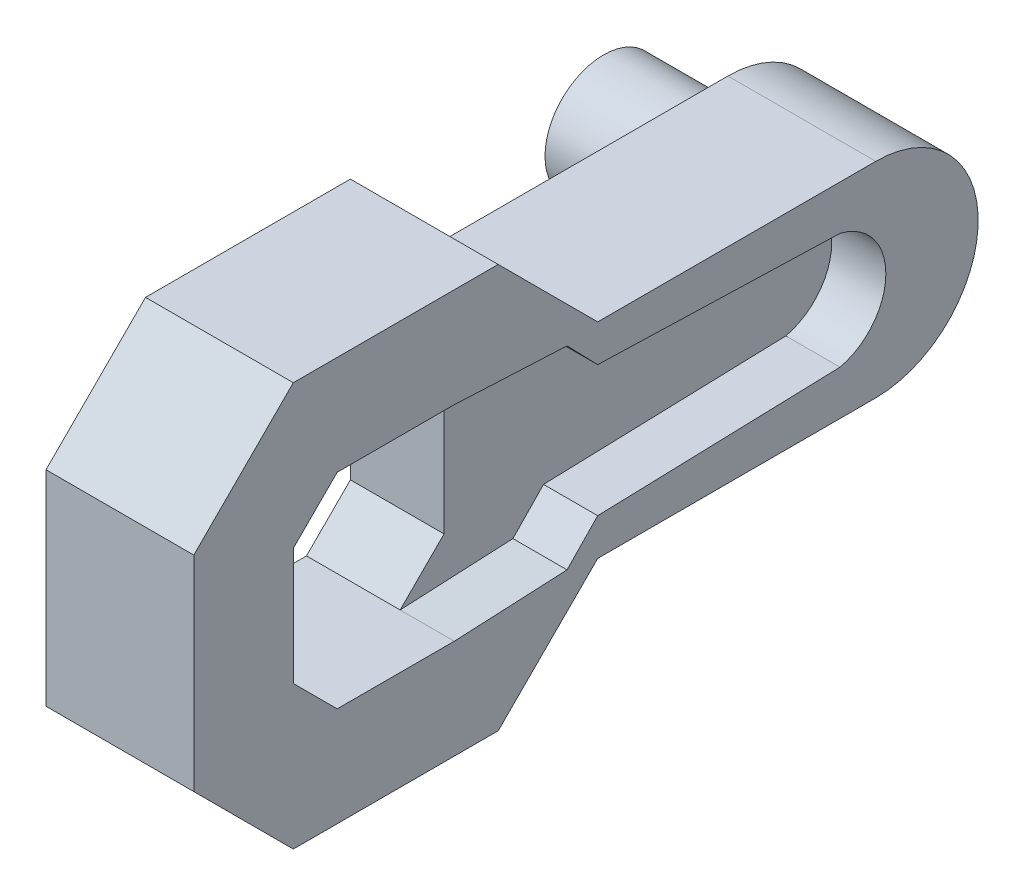
ISO-10303-21;
HEADER;
FILE_DESCRIPTION(('STEP AP214'),'2;1');
FILE_NAME('part.step','',(''),(''),'','','');
FILE_SCHEMA(('AUTOMOTIVE_DESIGN { 1 0 10303 214 1 1 1 1 }'));
ENDSEC;
DATA;
#1=APPLICATION_CONTEXT('core data for automotive mechanical design processes');
#2=APPLICATION_PROTOCOL_DEFINITION('international standard','automotive_design',2000,#1);
#3=PRODUCT_CONTEXT('',#1,'mechanical');
#4=PRODUCT('Part','Part','',(#3));
#5=PRODUCT_RELATED_PRODUCT_CATEGORY('part','',(#4));
#6=PRODUCT_DEFINITION_FORMATION('','',#4);
#7=PRODUCT_DEFINITION_CONTEXT('part definition',#1,'design');
#8=PRODUCT_DEFINITION('design','',#6,#7);
#9=PRODUCT_DEFINITION_SHAPE('','',#8);
#10=(LENGTH_UNIT() NAMED_UNIT(*) SI_UNIT(.MILLI.,.METRE.));
#11=(NAMED_UNIT(*) PLANE_ANGLE_UNIT() SI_UNIT($,.RADIAN.));
#12=(NAMED_UNIT(*) SI_UNIT($,.STERADIAN.) SOLID_ANGLE_UNIT());
#13=UNCERTAINTY_MEASURE_WITH_UNIT(LENGTH_MEASURE(1.E-05),#10,'distance_accuracy_value','');
#14=(GEOMETRIC_REPRESENTATION_CONTEXT(3) GLOBAL_UNCERTAINTY_ASSIGNED_CONTEXT((#13)) GLOBAL_UNIT_ASSIGNED_CONTEXT((#10,
#11,#12)) REPRESENTATION_CONTEXT('',''));
#15=CARTESIAN_POINT('',(0.,0.,0.));
#16=DIRECTION('',(0.,0.,1.));
#17=DIRECTION('',(1.,0.,0.));
#18=AXIS2_PLACEMENT_3D('',#15,#16,#17);
#19=CARTESIAN_POINT('',(3.2,0.,0.));
#20=DIRECTION('',(1.,0.,0.));
#21=DIRECTION('',(0.,0.,-1.));
#22=AXIS2_PLACEMENT_3D('',#19,#20,#21);
#23=PLANE('',#22);
#24=DIRECTION('',(0.,0.707106781186544,-0.707106781186551));
#25=VECTOR('',#24,1.);
#26=CARTESIAN_POINT('',(3.2,-3.5,-1.99999999999999));
#27=LINE('',#26,#25);
#28=CARTESIAN_POINT('',(3.2,-2.00000000000001,-3.5));
#29=VERTEX_POINT('',#28);
#30=CARTESIAN_POINT('',(3.2,-3.5,-1.99999999999999));
#31=VERTEX_POINT('',#30);
#32=EDGE_CURVE('E398',#29,#31,#27,.F.);
#33=ORIENTED_EDGE('',*,*,#32,.T.);
#34=DIRECTION('',(0.,-0.0481321510759977,0.998840976348486));
#35=VECTOR('',#34,1.);
#36=CARTESIAN_POINT('',(3.2,-3.58804426566379,-0.172900684645164));
#37=LINE('',#36,#35);
#38=CARTESIAN_POINT('',(3.2,-3.31433472381521,-5.85293575276977));
#39=VERTEX_POINT('',#38);
#40=EDGE_CURVE('E247',#39,#31,#37,.T.);
#41=ORIENTED_EDGE('',*,*,#40,.F.);
#42=DIRECTION('',(0.,-0.717900092453598,0.696146146477243));
#43=VECTOR('',#42,1.);
#44=CARTESIAN_POINT('',(3.2,-2.23455065304895,-6.90000000000001));
#45=LINE('',#44,#43);
#46=CARTESIAN_POINT('',(3.2,-2.23455065304895,-6.90000000000001));
#47=VERTEX_POINT('',#46);
#48=EDGE_CURVE('E299',#47,#39,#45,.T.);
#49=ORIENTED_EDGE('',*,*,#48,.F.);
#50=DIRECTION('',(0.,-0.0307610854897689,0.999526765834458));
#51=VECTOR('',#50,1.);
#52=CARTESIAN_POINT('',(3.2,-2.23455065304895,-6.90000000000001));
#53=LINE('',#52,#51);
#54=CARTESIAN_POINT('',(3.2,-1.97976035461889,-15.1789576148247));
#55=VERTEX_POINT('',#54);
#56=EDGE_CURVE('E315',#55,#47,#53,.T.);
#57=ORIENTED_EDGE('',*,*,#56,.F.);
#58=CARTESIAN_POINT('',(3.2,0.,-14.7117047366577));
#59=DIRECTION('',(-1.,0.,0.));
#60=DIRECTION('',(0.,0.,-1.));
#61=AXIS2_PLACEMENT_3D('',#58,#59,#60);
#62=CIRCLE('',#61,2.03415248048815);
#63=CARTESIAN_POINT('',(3.2,1.97976035461889,-15.1789576148247));
#64=VERTEX_POINT('',#63);
#65=EDGE_CURVE('E313',#64,#55,#62,.T.);
#66=ORIENTED_EDGE('',*,*,#65,.F.);
#67=DIRECTION('',(0.,-0.0307610854897688,-0.999526765834458));
#68=VECTOR('',#67,1.);
#69=CARTESIAN_POINT('',(3.2,2.23455065304895,-6.90000000000001));
#70=LINE('',#69,#68);
#71=CARTESIAN_POINT('',(3.2,2.23455065304895,-6.90000000000001));
#72=VERTEX_POINT('',#71);
#73=EDGE_CURVE('E311',#72,#64,#70,.T.);
#74=ORIENTED_EDGE('',*,*,#73,.F.);
#75=DIRECTION('',(0.,-0.717900092453598,-0.696146146477243));
#76=VECTOR('',#75,1.);
#77=CARTESIAN_POINT('',(3.2,2.23455065304895,-6.90000000000001));
#78=LINE('',#77,#76);
#79=CARTESIAN_POINT('',(3.2,3.31433472381521,-5.85293575276977));
#80=VERTEX_POINT('',#79);
#81=EDGE_CURVE('E294',#80,#72,#78,.T.);
#82=ORIENTED_EDGE('',*,*,#81,.F.);
#83=DIRECTION('',(0.,0.0481321510759978,0.998840976348486));
#84=VECTOR('',#83,1.);
#85=CARTESIAN_POINT('',(3.2,3.5880442656638,-0.172900684645164));
#86=LINE('',#85,#84);
#87=CARTESIAN_POINT('',(3.2,3.5,-2.00000000000001));
#88=VERTEX_POINT('',#87);
#89=EDGE_CURVE('E244',#80,#88,#86,.T.);
#90=ORIENTED_EDGE('',*,*,#89,.T.);
#91=DIRECTION('',(0.,0.707106781186551,0.707106781186544));
#92=VECTOR('',#91,1.);
#93=CARTESIAN_POINT('',(3.2,2.,-3.5));
#94=LINE('',#93,#92);
#95=CARTESIAN_POINT('',(3.2,2.,-3.5));
#96=VERTEX_POINT('',#95);
#97=EDGE_CURVE('E394',#88,#96,#94,.F.);
#98=ORIENTED_EDGE('',*,*,#97,.T.);
#99=DIRECTION('',(0.,1.,0.));
#100=VECTOR('',#99,1.);
#101=CARTESIAN_POINT('',(3.2,-3.5,-3.5));
#102=LINE('',#101,#100);
#103=EDGE_CURVE('E338',#29,#96,#102,.T.);
#104=ORIENTED_EDGE('',*,*,#103,.F.);
#105=EDGE_LOOP('',(#33,#41,#49,#57,#66,#74,#82,#90,#98,#104));
#106=FACE_BOUND('',#105,.T.);
#107=ADVANCED_FACE('F42',(#106),#23,.T.);
#108=CARTESIAN_POINT('',(0.,0.,0.));
#109=DIRECTION('',(1.,0.,0.));
#110=DIRECTION('',(0.,0.,-1.));
#111=AXIS2_PLACEMENT_3D('',#108,#109,#110);
#112=PLANE('',#111);
#113=CARTESIAN_POINT('',(0.,0.,-16.4));
#114=DIRECTION('',(1.,0.,0.));
#115=DIRECTION('',(0.,0.,-1.));
#116=AXIS2_PLACEMENT_3D('',#113,#114,#115);
#117=CIRCLE('',#116,2.);
#118=CARTESIAN_POINT('',(0.,0.,-18.4));
#119=VERTEX_POINT('',#118);
#120=EDGE_CURVE('E11',#119,#119,#117,.F.);
#121=ORIENTED_EDGE('',*,*,#120,.F.);
#122=EDGE_LOOP('',(#121));
#123=FACE_BOUND('',#122,.T.);
#124=DIRECTION('',(0.,0.,-1.));
#125=VECTOR('',#124,1.);
#126=CARTESIAN_POINT('',(0.,-3.5,-6.90000000000001));
#127=LINE('',#126,#125);
#128=CARTESIAN_POINT('',(0.,-3.5,-6.90000000000001));
#129=VERTEX_POINT('',#128);
#130=CARTESIAN_POINT('',(0.,-3.5,-16.4));
#131=VERTEX_POINT('',#130);
#132=EDGE_CURVE('E360',#129,#131,#127,.T.);
#133=ORIENTED_EDGE('',*,*,#132,.F.);
#134=DIRECTION('',(0.,0.707106781186546,-0.707106781186549));
#135=VECTOR('',#134,1.);
#136=CARTESIAN_POINT('',(0.,-3.5,-6.90000000000001));
#137=LINE('',#136,#135);
#138=CARTESIAN_POINT('',(0.,-6.9,-3.49999999999999));
#139=VERTEX_POINT('',#138);
#140=EDGE_CURVE('E228',#129,#139,#137,.F.);
#141=ORIENTED_EDGE('',*,*,#140,.T.);
#142=DIRECTION('',(0.,0.,-1.));
#143=VECTOR('',#142,1.);
#144=CARTESIAN_POINT('',(0.,-6.9,6.9));
#145=LINE('',#144,#143);
#146=CARTESIAN_POINT('',(0.,-6.9,3.5));
#147=VERTEX_POINT('',#146);
#148=EDGE_CURVE('E358',#147,#139,#145,.T.);
#149=ORIENTED_EDGE('',*,*,#148,.F.);
#150=DIRECTION('',(0.,-0.707106781186549,-0.707106781186546));
#151=VECTOR('',#150,1.);
#152=CARTESIAN_POINT('',(0.,-6.9,3.5));
#153=LINE('',#152,#151);
#154=CARTESIAN_POINT('',(0.,-3.49999999999999,6.9));
#155=VERTEX_POINT('',#154);
#156=EDGE_CURVE('E223',#147,#155,#153,.F.);
#157=ORIENTED_EDGE('',*,*,#156,.T.);
#158=DIRECTION('',(0.,-1.,0.));
#159=VECTOR('',#158,1.);
#160=CARTESIAN_POINT('',(0.,-6.9,6.9));
#161=LINE('',#160,#159);
#162=CARTESIAN_POINT('',(0.,3.5,6.9));
#163=VERTEX_POINT('',#162);
#164=EDGE_CURVE('E355',#163,#155,#161,.T.);
#165=ORIENTED_EDGE('',*,*,#164,.F.);
#166=DIRECTION('',(0.,-0.707106781186546,0.707106781186549));
#167=VECTOR('',#166,1.);
#168=CARTESIAN_POINT('',(0.,3.50000000000001,6.9));
#169=LINE('',#168,#167);
#170=CARTESIAN_POINT('',(0.,6.9,3.49999999999999));
#171=VERTEX_POINT('',#170);
#172=EDGE_CURVE('E58',#163,#171,#169,.F.);
#173=ORIENTED_EDGE('',*,*,#172,.T.);
#174=DIRECTION('',(0.,0.,1.));
#175=VECTOR('',#174,1.);
#176=CARTESIAN_POINT('',(0.,6.9,6.9));
#177=LINE('',#176,#175);
#178=CARTESIAN_POINT('',(0.,6.9,-3.50000000000001));
#179=VERTEX_POINT('',#178);
#180=EDGE_CURVE('E341',#179,#171,#177,.T.);
#181=ORIENTED_EDGE('',*,*,#180,.F.);
#182=DIRECTION('',(0.,0.707106781186548,0.707106781186547));
#183=VECTOR('',#182,1.);
#184=CARTESIAN_POINT('',(0.,6.9,-3.50000000000001));
#185=LINE('',#184,#183);
#186=CARTESIAN_POINT('',(0.,3.5,-6.90000000000001));
#187=VERTEX_POINT('',#186);
#188=EDGE_CURVE('E66',#179,#187,#185,.F.);
#189=ORIENTED_EDGE('',*,*,#188,.T.);
#190=DIRECTION('',(0.,0.,1.));
#191=VECTOR('',#190,1.);
#192=CARTESIAN_POINT('',(0.,3.5,-6.90000000000001));
#193=LINE('',#192,#191);
#194=CARTESIAN_POINT('',(0.,3.5,-16.4));
#195=VERTEX_POINT('',#194);
#196=EDGE_CURVE('E363',#195,#187,#193,.T.);
#197=ORIENTED_EDGE('',*,*,#196,.F.);
#198=CARTESIAN_POINT('',(0.,0.,-16.4));
#199=DIRECTION('',(1.,0.,0.));
#200=DIRECTION('',(0.,0.,-1.));
#201=AXIS2_PLACEMENT_3D('',#198,#199,#200);
#202=CIRCLE('',#201,3.5);
#203=CARTESIAN_POINT('',(0.,0.,-19.9));
#204=VERTEX_POINT('',#203);
#205=EDGE_CURVE('E405',#195,#204,#202,.F.);
#206=ORIENTED_EDGE('',*,*,#205,.T.);
#207=CARTESIAN_POINT('',(0.,0.,-16.4));
#208=DIRECTION('',(1.,0.,0.));
#209=DIRECTION('',(0.,0.,-1.));
#210=AXIS2_PLACEMENT_3D('',#207,#208,#209);
#211=CIRCLE('',#210,3.5);
#212=EDGE_CURVE('E407',#204,#131,#211,.F.);
#213=ORIENTED_EDGE('',*,*,#212,.T.);
#214=EDGE_LOOP('',(#133,#141,#149,#157,#165,#173,#181,#189,#197,#206,#213));
#215=FACE_BOUND('',#214,.T.);
#216=DIRECTION('',(0.,0.,-1.));
#217=VECTOR('',#216,1.);
#218=CARTESIAN_POINT('',(0.,-3.5,3.5));
#219=LINE('',#218,#217);
#220=CARTESIAN_POINT('',(0.,-3.5,2.));
#221=VERTEX_POINT('',#220);
#222=CARTESIAN_POINT('',(0.,-3.5,-1.99999999999999));
#223=VERTEX_POINT('',#222);
#224=EDGE_CURVE('E342',#221,#223,#219,.T.);
#225=ORIENTED_EDGE('',*,*,#224,.T.);
#226=DIRECTION('',(0.,-0.707106781186544,0.707106781186551));
#227=VECTOR('',#226,1.);
#228=CARTESIAN_POINT('',(0.,-2.75000000000001,-2.74999999999999));
#229=LINE('',#228,#227);
#230=CARTESIAN_POINT('',(0.,-2.00000000000001,-3.5));
#231=VERTEX_POINT('',#230);
#232=EDGE_CURVE('E396',#223,#231,#229,.F.);
#233=ORIENTED_EDGE('',*,*,#232,.T.);
#234=DIRECTION('',(0.,1.,0.));
#235=VECTOR('',#234,1.);
#236=CARTESIAN_POINT('',(0.,-3.5,-3.5));
#237=LINE('',#236,#235);
#238=CARTESIAN_POINT('',(0.,2.,-3.5));
#239=VERTEX_POINT('',#238);
#240=EDGE_CURVE('E343',#231,#239,#237,.T.);
#241=ORIENTED_EDGE('',*,*,#240,.T.);
#242=DIRECTION('',(0.,-0.707106781186551,-0.707106781186544));
#243=VECTOR('',#242,1.);
#244=CARTESIAN_POINT('',(0.,2.74999999999999,-2.75000000000001));
#245=LINE('',#244,#243);
#246=CARTESIAN_POINT('',(0.,3.5,-2.00000000000001));
#247=VERTEX_POINT('',#246);
#248=EDGE_CURVE('E392',#239,#247,#245,.F.);
#249=ORIENTED_EDGE('',*,*,#248,.T.);
#250=DIRECTION('',(0.,0.,1.));
#251=VECTOR('',#250,1.);
#252=CARTESIAN_POINT('',(0.,3.5,3.5));
#253=LINE('',#252,#251);
#254=CARTESIAN_POINT('',(0.,3.5,1.99999999999999));
#255=VERTEX_POINT('',#254);
#256=EDGE_CURVE('E346',#247,#255,#253,.T.);
#257=ORIENTED_EDGE('',*,*,#256,.T.);
#258=DIRECTION('',(0.,0.707106781186544,-0.707106781186551));
#259=VECTOR('',#258,1.);
#260=CARTESIAN_POINT('',(0.,2.75000000000001,2.74999999999999));
#261=LINE('',#260,#259);
#262=CARTESIAN_POINT('',(0.,2.00000000000001,3.5));
#263=VERTEX_POINT('',#262);
#264=EDGE_CURVE('E403',#255,#263,#261,.F.);
#265=ORIENTED_EDGE('',*,*,#264,.T.);
#266=DIRECTION('',(0.,-1.,0.));
#267=VECTOR('',#266,1.);
#268=CARTESIAN_POINT('',(0.,-3.5,3.5));
#269=LINE('',#268,#267);
#270=CARTESIAN_POINT('',(0.,-1.99999999999999,3.5));
#271=VERTEX_POINT('',#270);
#272=EDGE_CURVE('E349',#263,#271,#269,.T.);
#273=ORIENTED_EDGE('',*,*,#272,.T.);
#274=DIRECTION('',(0.,0.707106781186551,0.707106781186544));
#275=VECTOR('',#274,1.);
#276=CARTESIAN_POINT('',(0.,-2.74999999999999,2.75000000000001));
#277=LINE('',#276,#275);
#278=EDGE_CURVE('E401',#271,#221,#277,.F.);
#279=ORIENTED_EDGE('',*,*,#278,.T.);
#280=EDGE_LOOP('',(#225,#233,#241,#249,#257,#265,#273,#279));
#281=FACE_BOUND('',#280,.T.);
#282=ADVANCED_FACE('F436',(#123,#215,#281),#112,.F.);
#283=CARTESIAN_POINT('',(3.2,6.9,6.9));
#284=DIRECTION('',(0.,-1.,0.));
#285=DIRECTION('',(0.,0.,-1.));
#286=AXIS2_PLACEMENT_3D('',#283,#284,#285);
#287=PLANE('',#286);
#288=ORIENTED_EDGE('',*,*,#180,.T.);
#289=DIRECTION('',(1.,0.,0.));
#290=VECTOR('',#289,1.);
#291=CARTESIAN_POINT('',(3.2,6.9,3.49999999999999));
#292=LINE('',#291,#290);
#293=CARTESIAN_POINT('',(5.05,6.9,3.49999999999999));
#294=VERTEX_POINT('',#293);
#295=EDGE_CURVE('E51',#171,#294,#292,.T.);
#296=ORIENTED_EDGE('',*,*,#295,.T.);
#297=DIRECTION('',(0.,0.,1.));
#298=VECTOR('',#297,1.);
#299=CARTESIAN_POINT('',(5.05,6.9,0.));
#300=LINE('',#299,#298);
#301=CARTESIAN_POINT('',(5.05,6.9,-3.5));
#302=VERTEX_POINT('',#301);
#303=EDGE_CURVE('E263',#302,#294,#300,.T.);
#304=ORIENTED_EDGE('',*,*,#303,.F.);
#305=DIRECTION('',(-1.,0.,0.));
#306=VECTOR('',#305,1.);
#307=CARTESIAN_POINT('',(3.2,6.9,-3.50000000000001));
#308=LINE('',#307,#306);
#309=EDGE_CURVE('E424',#302,#179,#308,.T.);
#310=ORIENTED_EDGE('',*,*,#309,.T.);
#311=EDGE_LOOP('',(#288,#296,#304,#310));
#312=FACE_BOUND('',#311,.T.);
#313=ADVANCED_FACE('F428',(#312),#287,.F.);
#314=CARTESIAN_POINT('',(3.2,-6.9,6.9));
#315=DIRECTION('',(0.,0.,-1.));
#316=DIRECTION('',(-1.,0.,0.));
#317=AXIS2_PLACEMENT_3D('',#314,#315,#316);
#318=PLANE('',#317);
#319=ORIENTED_EDGE('',*,*,#164,.T.);
#320=DIRECTION('',(1.,0.,0.));
#321=VECTOR('',#320,1.);
#322=CARTESIAN_POINT('',(3.2,-3.49999999999999,6.9));
#323=LINE('',#322,#321);
#324=CARTESIAN_POINT('',(5.05,-3.49999999999999,6.9));
#325=VERTEX_POINT('',#324);
#326=EDGE_CURVE('E422',#155,#325,#323,.T.);
#327=ORIENTED_EDGE('',*,*,#326,.T.);
#328=DIRECTION('',(0.,-1.,0.));
#329=VECTOR('',#328,1.);
#330=CARTESIAN_POINT('',(5.05,0.,6.9));
#331=LINE('',#330,#329);
#332=CARTESIAN_POINT('',(5.05,3.5,6.9));
#333=VERTEX_POINT('',#332);
#334=EDGE_CURVE('E243',#333,#325,#331,.T.);
#335=ORIENTED_EDGE('',*,*,#334,.F.);
#336=DIRECTION('',(-1.,0.,0.));
#337=VECTOR('',#336,1.);
#338=CARTESIAN_POINT('',(3.2,3.50000000000001,6.9));
#339=LINE('',#338,#337);
#340=EDGE_CURVE('E419',#333,#163,#339,.T.);
#341=ORIENTED_EDGE('',*,*,#340,.T.);
#342=EDGE_LOOP('',(#319,#327,#335,#341));
#343=FACE_BOUND('',#342,.T.);
#344=ADVANCED_FACE('F434',(#343),#318,.F.);
#345=CARTESIAN_POINT('',(3.2,-6.9,6.9));
#346=DIRECTION('',(0.,1.,0.));
#347=DIRECTION('',(0.,0.,1.));
#348=AXIS2_PLACEMENT_3D('',#345,#346,#347);
#349=PLANE('',#348);
#350=ORIENTED_EDGE('',*,*,#148,.T.);
#351=DIRECTION('',(1.,0.,0.));
#352=VECTOR('',#351,1.);
#353=CARTESIAN_POINT('',(3.2,-6.9,-3.5));
#354=LINE('',#353,#352);
#355=CARTESIAN_POINT('',(5.05,-6.9,-3.49999999999999));
#356=VERTEX_POINT('',#355);
#357=EDGE_CURVE('E227',#139,#356,#354,.T.);
#358=ORIENTED_EDGE('',*,*,#357,.T.);
#359=DIRECTION('',(0.,0.,-1.));
#360=VECTOR('',#359,1.);
#361=CARTESIAN_POINT('',(5.05,-6.9,0.));
#362=LINE('',#361,#360);
#363=CARTESIAN_POINT('',(5.05,-6.9,3.5));
#364=VERTEX_POINT('',#363);
#365=EDGE_CURVE('E231',#364,#356,#362,.T.);
#366=ORIENTED_EDGE('',*,*,#365,.F.);
#367=DIRECTION('',(-1.,0.,0.));
#368=VECTOR('',#367,1.);
#369=CARTESIAN_POINT('',(3.2,-6.9,3.5));
#370=LINE('',#369,#368);
#371=EDGE_CURVE('E217',#364,#147,#370,.T.);
#372=ORIENTED_EDGE('',*,*,#371,.T.);
#373=EDGE_LOOP('',(#350,#358,#366,#372));
#374=FACE_BOUND('',#373,.T.);
#375=ADVANCED_FACE('F232',(#374),#349,.F.);
#376=CARTESIAN_POINT('',(3.2,-3.5,-6.90000000000001));
#377=DIRECTION('',(0.,1.,0.));
#378=DIRECTION('',(0.,0.,1.));
#379=AXIS2_PLACEMENT_3D('',#376,#377,#378);
#380=PLANE('',#379);
#381=ORIENTED_EDGE('',*,*,#132,.T.);
#382=DIRECTION('',(-1.,0.,0.));
#383=VECTOR('',#382,1.);
#384=CARTESIAN_POINT('',(3.2,-3.5,-16.4));
#385=LINE('',#384,#383);
#386=CARTESIAN_POINT('',(5.05,-3.5,-16.4));
#387=VERTEX_POINT('',#386);
#388=EDGE_CURVE('E409',#131,#387,#385,.F.);
#389=ORIENTED_EDGE('',*,*,#388,.T.);
#390=DIRECTION('',(0.,0.,-1.));
#391=VECTOR('',#390,1.);
#392=CARTESIAN_POINT('',(5.05,-3.5,0.));
#393=LINE('',#392,#391);
#394=CARTESIAN_POINT('',(5.05,-3.5,-6.90000000000001));
#395=VERTEX_POINT('',#394);
#396=EDGE_CURVE('E251',#395,#387,#393,.T.);
#397=ORIENTED_EDGE('',*,*,#396,.F.);
#398=DIRECTION('',(-1.,0.,0.));
#399=VECTOR('',#398,1.);
#400=CARTESIAN_POINT('',(3.2,-3.5,-6.90000000000001));
#401=LINE('',#400,#399);
#402=EDGE_CURVE('E368',#395,#129,#401,.T.);
#403=ORIENTED_EDGE('',*,*,#402,.T.);
#404=EDGE_LOOP('',(#381,#389,#397,#403));
#405=FACE_BOUND('',#404,.T.);
#406=ADVANCED_FACE('F443',(#405),#380,.F.);
#407=CARTESIAN_POINT('',(3.2,3.5,-6.90000000000001));
#408=DIRECTION('',(0.,-1.,0.));
#409=DIRECTION('',(0.,0.,-1.));
#410=AXIS2_PLACEMENT_3D('',#407,#408,#409);
#411=PLANE('',#410);
#412=DIRECTION('',(-1.,0.,0.));
#413=VECTOR('',#412,1.);
#414=CARTESIAN_POINT('',(3.2,3.5,-6.90000000000001));
#415=LINE('',#414,#413);
#416=CARTESIAN_POINT('',(5.05,3.5,-6.90000000000001));
#417=VERTEX_POINT('',#416);
#418=EDGE_CURVE('E366',#417,#187,#415,.T.);
#419=ORIENTED_EDGE('',*,*,#418,.F.);
#420=DIRECTION('',(0.,0.,1.));
#421=VECTOR('',#420,1.);
#422=CARTESIAN_POINT('',(5.05,3.5,0.));
#423=LINE('',#422,#421);
#424=CARTESIAN_POINT('',(5.05,3.5,-16.4));
#425=VERTEX_POINT('',#424);
#426=EDGE_CURVE('E257',#425,#417,#423,.T.);
#427=ORIENTED_EDGE('',*,*,#426,.F.);
#428=DIRECTION('',(-1.,0.,0.));
#429=VECTOR('',#428,1.);
#430=CARTESIAN_POINT('',(3.2,3.5,-16.4));
#431=LINE('',#430,#429);
#432=EDGE_CURVE('E411',#425,#195,#431,.T.);
#433=ORIENTED_EDGE('',*,*,#432,.T.);
#434=ORIENTED_EDGE('',*,*,#196,.T.);
#435=EDGE_LOOP('',(#419,#427,#433,#434));
#436=FACE_BOUND('',#435,.T.);
#437=ADVANCED_FACE('F451',(#436),#411,.F.);
#438=CARTESIAN_POINT('',(3.2,-3.5,-3.5));
#439=DIRECTION('',(0.,0.,1.));
#440=DIRECTION('',(1.,0.,0.));
#441=AXIS2_PLACEMENT_3D('',#438,#439,#440);
#442=PLANE('',#441);
#443=ORIENTED_EDGE('',*,*,#103,.T.);
#444=DIRECTION('',(-1.,0.,0.));
#445=VECTOR('',#444,1.);
#446=CARTESIAN_POINT('',(0.,2.,-3.5));
#447=LINE('',#446,#445);
#448=EDGE_CURVE('E373',#96,#239,#447,.T.);
#449=ORIENTED_EDGE('',*,*,#448,.T.);
#450=ORIENTED_EDGE('',*,*,#240,.F.);
#451=DIRECTION('',(1.,0.,0.));
#452=VECTOR('',#451,1.);
#453=CARTESIAN_POINT('',(3.2,-2.00000000000001,-3.5));
#454=LINE('',#453,#452);
#455=EDGE_CURVE('E371',#231,#29,#454,.T.);
#456=ORIENTED_EDGE('',*,*,#455,.T.);
#457=EDGE_LOOP('',(#443,#449,#450,#456));
#458=FACE_BOUND('',#457,.T.);
#459=ADVANCED_FACE('F472',(#458),#442,.T.);
#460=CARTESIAN_POINT('',(3.2,3.5,3.5));
#461=DIRECTION('',(0.,-1.,0.));
#462=DIRECTION('',(0.,0.,-1.));
#463=AXIS2_PLACEMENT_3D('',#460,#461,#462);
#464=PLANE('',#463);
#465=ORIENTED_EDGE('',*,*,#256,.F.);
#466=DIRECTION('',(1.,0.,0.));
#467=VECTOR('',#466,1.);
#468=CARTESIAN_POINT('',(3.2,3.5,-2.00000000000001));
#469=LINE('',#468,#467);
#470=EDGE_CURVE('E379',#247,#88,#469,.T.);
#471=ORIENTED_EDGE('',*,*,#470,.T.);
#472=DIRECTION('',(-1.,0.,0.));
#473=VECTOR('',#472,1.);
#474=CARTESIAN_POINT('',(5.05,3.5,-2.00000000000001));
#475=LINE('',#474,#473);
#476=CARTESIAN_POINT('',(5.05,3.5,-2.00000000000001));
#477=VERTEX_POINT('',#476);
#478=EDGE_CURVE('E288',#477,#88,#475,.T.);
#479=ORIENTED_EDGE('',*,*,#478,.F.);
#480=DIRECTION('',(0.,0.,-1.));
#481=VECTOR('',#480,1.);
#482=CARTESIAN_POINT('',(5.05,3.5,0.));
#483=LINE('',#482,#481);
#484=CARTESIAN_POINT('',(5.05,3.5,1.99999999999999));
#485=VERTEX_POINT('',#484);
#486=EDGE_CURVE('E283',#485,#477,#483,.T.);
#487=ORIENTED_EDGE('',*,*,#486,.F.);
#488=DIRECTION('',(-1.,0.,0.));
#489=VECTOR('',#488,1.);
#490=CARTESIAN_POINT('',(0.,3.5,1.99999999999999));
#491=LINE('',#490,#489);
#492=EDGE_CURVE('E376',#485,#255,#491,.T.);
#493=ORIENTED_EDGE('',*,*,#492,.T.);
#494=EDGE_LOOP('',(#465,#471,#479,#487,#493));
#495=FACE_BOUND('',#494,.T.);
#496=ADVANCED_FACE('F622',(#495),#464,.T.);
#497=CARTESIAN_POINT('',(3.2,-3.5,3.5));
#498=DIRECTION('',(0.,0.,-1.));
#499=DIRECTION('',(-1.,0.,0.));
#500=AXIS2_PLACEMENT_3D('',#497,#498,#499);
#501=PLANE('',#500);
#502=DIRECTION('',(1.,0.,0.));
#503=VECTOR('',#502,1.);
#504=CARTESIAN_POINT('',(3.2,2.00000000000001,3.5));
#505=LINE('',#504,#503);
#506=CARTESIAN_POINT('',(5.05,2.00000000000001,3.5));
#507=VERTEX_POINT('',#506);
#508=EDGE_CURVE('E387',#263,#507,#505,.T.);
#509=ORIENTED_EDGE('',*,*,#508,.T.);
#510=DIRECTION('',(0.,1.,0.));
#511=VECTOR('',#510,1.);
#512=CARTESIAN_POINT('',(5.05,0.,3.5));
#513=LINE('',#512,#511);
#514=CARTESIAN_POINT('',(5.05,-1.99999999999999,3.5));
#515=VERTEX_POINT('',#514);
#516=EDGE_CURVE('E277',#515,#507,#513,.T.);
#517=ORIENTED_EDGE('',*,*,#516,.F.);
#518=DIRECTION('',(-1.,0.,0.));
#519=VECTOR('',#518,1.);
#520=CARTESIAN_POINT('',(0.,-1.99999999999999,3.5));
#521=LINE('',#520,#519);
#522=EDGE_CURVE('E389',#515,#271,#521,.T.);
#523=ORIENTED_EDGE('',*,*,#522,.T.);
#524=ORIENTED_EDGE('',*,*,#272,.F.);
#525=EDGE_LOOP('',(#509,#517,#523,#524));
#526=FACE_BOUND('',#525,.T.);
#527=ADVANCED_FACE('F619',(#526),#501,.T.);
#528=CARTESIAN_POINT('',(3.2,-3.5,3.5));
#529=DIRECTION('',(0.,1.,0.));
#530=DIRECTION('',(0.,0.,1.));
#531=AXIS2_PLACEMENT_3D('',#528,#529,#530);
#532=PLANE('',#531);
#533=DIRECTION('',(1.,0.,0.));
#534=VECTOR('',#533,1.);
#535=CARTESIAN_POINT('',(3.2,-3.5,2.));
#536=LINE('',#535,#534);
#537=CARTESIAN_POINT('',(5.05,-3.5,2.));
#538=VERTEX_POINT('',#537);
#539=EDGE_CURVE('E382',#221,#538,#536,.T.);
#540=ORIENTED_EDGE('',*,*,#539,.T.);
#541=DIRECTION('',(0.,0.,1.));
#542=VECTOR('',#541,1.);
#543=CARTESIAN_POINT('',(5.05,-3.5,0.));
#544=LINE('',#543,#542);
#545=CARTESIAN_POINT('',(5.05,-3.5,-1.99999999999999));
#546=VERTEX_POINT('',#545);
#547=EDGE_CURVE('E271',#546,#538,#544,.T.);
#548=ORIENTED_EDGE('',*,*,#547,.F.);
#549=DIRECTION('',(-1.,0.,0.));
#550=VECTOR('',#549,1.);
#551=CARTESIAN_POINT('',(5.05,-3.5,-1.99999999999999));
#552=LINE('',#551,#550);
#553=EDGE_CURVE('E291',#546,#31,#552,.T.);
#554=ORIENTED_EDGE('',*,*,#553,.T.);
#555=DIRECTION('',(-1.,0.,0.));
#556=VECTOR('',#555,1.);
#557=CARTESIAN_POINT('',(0.,-3.5,-1.99999999999999));
#558=LINE('',#557,#556);
#559=EDGE_CURVE('E384',#31,#223,#558,.T.);
#560=ORIENTED_EDGE('',*,*,#559,.T.);
#561=ORIENTED_EDGE('',*,*,#224,.F.);
#562=EDGE_LOOP('',(#540,#548,#554,#560,#561));
#563=FACE_BOUND('',#562,.T.);
#564=ADVANCED_FACE('F493',(#563),#532,.T.);
#565=CARTESIAN_POINT('',(3.2,2.,-3.5));
#566=DIRECTION('',(0.,-0.707106781186544,0.707106781186551));
#567=DIRECTION('',(1.,0.,0.));
#568=AXIS2_PLACEMENT_3D('',#565,#566,#567);
#569=PLANE('',#568);
#570=ORIENTED_EDGE('',*,*,#97,.F.);
#571=ORIENTED_EDGE('',*,*,#470,.F.);
#572=ORIENTED_EDGE('',*,*,#248,.F.);
#573=ORIENTED_EDGE('',*,*,#448,.F.);
#574=EDGE_LOOP('',(#570,#571,#572,#573));
#575=FACE_BOUND('',#574,.T.);
#576=ADVANCED_FACE('F486',(#575),#569,.T.);
#577=CARTESIAN_POINT('',(3.2,-3.5,-1.99999999999999));
#578=DIRECTION('',(0.,0.707106781186551,0.707106781186544));
#579=DIRECTION('',(1.,0.,0.));
#580=AXIS2_PLACEMENT_3D('',#577,#578,#579);
#581=PLANE('',#580);
#582=ORIENTED_EDGE('',*,*,#32,.F.);
#583=ORIENTED_EDGE('',*,*,#455,.F.);
#584=ORIENTED_EDGE('',*,*,#232,.F.);
#585=ORIENTED_EDGE('',*,*,#559,.F.);
#586=EDGE_LOOP('',(#582,#583,#584,#585));
#587=FACE_BOUND('',#586,.T.);
#588=ADVANCED_FACE('F492',(#587),#581,.T.);
#589=CARTESIAN_POINT('',(3.2,-1.99999999999999,3.5));
#590=DIRECTION('',(0.,0.707106781186544,-0.707106781186551));
#591=DIRECTION('',(1.,0.,0.));
#592=AXIS2_PLACEMENT_3D('',#589,#590,#591);
#593=PLANE('',#592);
#594=ORIENTED_EDGE('',*,*,#522,.F.);
#595=DIRECTION('',(0.,0.707106781186551,0.707106781186544));
#596=VECTOR('',#595,1.);
#597=CARTESIAN_POINT('',(5.05,-2.74999999999999,2.75000000000001));
#598=LINE('',#597,#596);
#599=EDGE_CURVE('E274',#538,#515,#598,.T.);
#600=ORIENTED_EDGE('',*,*,#599,.F.);
#601=ORIENTED_EDGE('',*,*,#539,.F.);
#602=ORIENTED_EDGE('',*,*,#278,.F.);
#603=EDGE_LOOP('',(#594,#600,#601,#602));
#604=FACE_BOUND('',#603,.T.);
#605=ADVANCED_FACE('F500',(#604),#593,.T.);
#606=CARTESIAN_POINT('',(3.2,3.5,1.99999999999999));
#607=DIRECTION('',(0.,-0.707106781186551,-0.707106781186544));
#608=DIRECTION('',(1.,0.,0.));
#609=AXIS2_PLACEMENT_3D('',#606,#607,#608);
#610=PLANE('',#609);
#611=ORIENTED_EDGE('',*,*,#492,.F.);
#612=DIRECTION('',(0.,0.707106781186544,-0.707106781186551));
#613=VECTOR('',#612,1.);
#614=CARTESIAN_POINT('',(5.05,2.75000000000001,2.74999999999999));
#615=LINE('',#614,#613);
#616=EDGE_CURVE('E280',#507,#485,#615,.T.);
#617=ORIENTED_EDGE('',*,*,#616,.F.);
#618=ORIENTED_EDGE('',*,*,#508,.F.);
#619=ORIENTED_EDGE('',*,*,#264,.F.);
#620=EDGE_LOOP('',(#611,#617,#618,#619));
#621=FACE_BOUND('',#620,.T.);
#622=ADVANCED_FACE('F507',(#621),#610,.T.);
#623=CARTESIAN_POINT('',(3.2,0.,-16.4));
#624=DIRECTION('',(-1.,0.,0.));
#625=DIRECTION('',(0.,0.,1.));
#626=AXIS2_PLACEMENT_3D('',#623,#624,#625);
#627=CYLINDRICAL_SURFACE('',#626,3.5);
#628=ORIENTED_EDGE('',*,*,#432,.F.);
#629=CARTESIAN_POINT('',(5.05,0.,-16.4));
#630=DIRECTION('',(1.,0.,0.));
#631=DIRECTION('',(0.,0.,-1.));
#632=AXIS2_PLACEMENT_3D('',#629,#630,#631);
#633=CIRCLE('',#632,3.5);
#634=EDGE_CURVE('E254',#387,#425,#633,.T.);
#635=ORIENTED_EDGE('',*,*,#634,.F.);
#636=ORIENTED_EDGE('',*,*,#388,.F.);
#637=ORIENTED_EDGE('',*,*,#212,.F.);
#638=DIRECTION('',(-1.,0.,0.));
#639=VECTOR('',#638,1.);
#640=CARTESIAN_POINT('',(3.2,0.,-19.9));
#641=LINE('',#640,#639);
#642=CARTESIAN_POINT('',(3.2,0.,-19.9));
#643=VERTEX_POINT('',#642);
#644=EDGE_CURVE('E337',#204,#643,#641,.F.);
#645=ORIENTED_EDGE('',*,*,#644,.T.);
#646=ORIENTED_EDGE('',*,*,#644,.F.);
#647=ORIENTED_EDGE('',*,*,#205,.F.);
#648=EDGE_LOOP('',(#628,#635,#636,#637,#645,#646,#647));
#649=FACE_BOUND('',#648,.T.);
#650=ADVANCED_FACE('F447',(#649),#627,.T.);
#651=CARTESIAN_POINT('',(3.2,-3.5,-6.90000000000001));
#652=DIRECTION('',(0.,0.707106781186549,0.707106781186546));
#653=DIRECTION('',(-1.,0.,0.));
#654=AXIS2_PLACEMENT_3D('',#651,#652,#653);
#655=PLANE('',#654);
#656=ORIENTED_EDGE('',*,*,#402,.F.);
#657=DIRECTION('',(0.,0.707106781186546,-0.707106781186549));
#658=VECTOR('',#657,1.);
#659=CARTESIAN_POINT('',(5.05,-5.20000000000001,-5.19999999999999));
#660=LINE('',#659,#658);
#661=EDGE_CURVE('E237',#356,#395,#660,.T.);
#662=ORIENTED_EDGE('',*,*,#661,.F.);
#663=ORIENTED_EDGE('',*,*,#357,.F.);
#664=ORIENTED_EDGE('',*,*,#140,.F.);
#665=EDGE_LOOP('',(#656,#662,#663,#664));
#666=FACE_BOUND('',#665,.T.);
#667=ADVANCED_FACE('F439',(#666),#655,.F.);
#668=CARTESIAN_POINT('',(3.2,-6.9,3.5));
#669=DIRECTION('',(0.,0.707106781186546,-0.707106781186549));
#670=DIRECTION('',(-1.,0.,0.));
#671=AXIS2_PLACEMENT_3D('',#668,#669,#670);
#672=PLANE('',#671);
#673=ORIENTED_EDGE('',*,*,#371,.F.);
#674=DIRECTION('',(0.,-0.707106781186549,-0.707106781186546));
#675=VECTOR('',#674,1.);
#676=CARTESIAN_POINT('',(5.05,-5.19999999999999,5.20000000000001));
#677=LINE('',#676,#675);
#678=EDGE_CURVE('E222',#325,#364,#677,.T.);
#679=ORIENTED_EDGE('',*,*,#678,.F.);
#680=ORIENTED_EDGE('',*,*,#326,.F.);
#681=ORIENTED_EDGE('',*,*,#156,.F.);
#682=EDGE_LOOP('',(#673,#679,#680,#681));
#683=FACE_BOUND('',#682,.T.);
#684=ADVANCED_FACE('F219',(#683),#672,.F.);
#685=CARTESIAN_POINT('',(3.2,3.50000000000001,6.9));
#686=DIRECTION('',(0.,-0.707106781186549,-0.707106781186546));
#687=DIRECTION('',(-1.,0.,0.));
#688=AXIS2_PLACEMENT_3D('',#685,#686,#687);
#689=PLANE('',#688);
#690=ORIENTED_EDGE('',*,*,#340,.F.);
#691=DIRECTION('',(0.,-0.707106781186546,0.707106781186549));
#692=VECTOR('',#691,1.);
#693=CARTESIAN_POINT('',(5.05,5.20000000000001,5.19999999999999));
#694=LINE('',#693,#692);
#695=EDGE_CURVE('E266',#294,#333,#694,.T.);
#696=ORIENTED_EDGE('',*,*,#695,.F.);
#697=ORIENTED_EDGE('',*,*,#295,.F.);
#698=ORIENTED_EDGE('',*,*,#172,.F.);
#699=EDGE_LOOP('',(#690,#696,#697,#698));
#700=FACE_BOUND('',#699,.T.);
#701=ADVANCED_FACE('F432',(#700),#689,.F.);
#702=CARTESIAN_POINT('',(3.2,6.9,-3.50000000000001));
#703=DIRECTION('',(0.,-0.707106781186547,0.707106781186548));
#704=DIRECTION('',(-1.,0.,0.));
#705=AXIS2_PLACEMENT_3D('',#702,#703,#704);
#706=PLANE('',#705);
#707=ORIENTED_EDGE('',*,*,#309,.F.);
#708=DIRECTION('',(0.,0.707106781186548,0.707106781186547));
#709=VECTOR('',#708,1.);
#710=CARTESIAN_POINT('',(5.05,5.2,-5.20000000000001));
#711=LINE('',#710,#709);
#712=EDGE_CURVE('E260',#417,#302,#711,.T.);
#713=ORIENTED_EDGE('',*,*,#712,.F.);
#714=ORIENTED_EDGE('',*,*,#418,.T.);
#715=ORIENTED_EDGE('',*,*,#188,.F.);
#716=EDGE_LOOP('',(#707,#713,#714,#715));
#717=FACE_BOUND('',#716,.T.);
#718=ADVANCED_FACE('F45',(#717),#706,.F.);
#719=CARTESIAN_POINT('',(-4.25,0.,-16.4));
#720=DIRECTION('',(1.,0.,0.));
#721=DIRECTION('',(0.,0.,-1.));
#722=AXIS2_PLACEMENT_3D('',#719,#720,#721);
#723=CYLINDRICAL_SURFACE('',#722,2.);
#724=CARTESIAN_POINT('',(-4.25,0.,-16.4));
#725=DIRECTION('',(-1.,0.,0.));
#726=DIRECTION('',(0.,0.,1.));
#727=AXIS2_PLACEMENT_3D('',#724,#725,#726);
#728=CIRCLE('',#727,2.);
#729=CARTESIAN_POINT('',(-4.25,0.,-14.4));
#730=VERTEX_POINT('',#729);
#731=EDGE_CURVE('E334',#730,#730,#728,.T.);
#732=ORIENTED_EDGE('',*,*,#731,.F.);
#733=EDGE_LOOP('',(#732));
#734=FACE_BOUND('',#733,.T.);
#735=ORIENTED_EDGE('',*,*,#120,.T.);
#736=EDGE_LOOP('',(#735));
#737=FACE_BOUND('',#736,.T.);
#738=ADVANCED_FACE('F455',(#734,#737),#723,.T.);
#739=CARTESIAN_POINT('',(-4.25,0.,-16.4));
#740=DIRECTION('',(-1.,0.,0.));
#741=DIRECTION('',(0.,0.,1.));
#742=AXIS2_PLACEMENT_3D('',#739,#740,#741);
#743=PLANE('',#742);
#744=ORIENTED_EDGE('',*,*,#731,.T.);
#745=EDGE_LOOP('',(#744));
#746=FACE_BOUND('',#745,.T.);
#747=ADVANCED_FACE('F460',(#746),#743,.T.);
#748=CARTESIAN_POINT('',(5.05,2.23455065304895,-6.90000000000001));
#749=DIRECTION('',(0.,0.696146146477243,-0.717900092453598));
#750=DIRECTION('',(0.,0.717900092453598,0.696146146477243));
#751=AXIS2_PLACEMENT_3D('',#748,#749,#750);
#752=PLANE('',#751);
#753=ORIENTED_EDGE('',*,*,#81,.T.);
#754=DIRECTION('',(-1.,0.,0.));
#755=VECTOR('',#754,1.);
#756=CARTESIAN_POINT('',(5.05,2.23455065304895,-6.90000000000001));
#757=LINE('',#756,#755);
#758=CARTESIAN_POINT('',(5.05,2.23455065304895,-6.90000000000001));
#759=VERTEX_POINT('',#758);
#760=EDGE_CURVE('E332',#759,#72,#757,.T.);
#761=ORIENTED_EDGE('',*,*,#760,.F.);
#762=DIRECTION('',(0.,-0.717900092453598,-0.696146146477243));
#763=VECTOR('',#762,1.);
#764=CARTESIAN_POINT('',(5.05,2.23455065304895,-6.90000000000001));
#765=LINE('',#764,#763);
#766=CARTESIAN_POINT('',(5.05,3.31433472381521,-5.85293575276977));
#767=VERTEX_POINT('',#766);
#768=EDGE_CURVE('E295',#767,#759,#765,.T.);
#769=ORIENTED_EDGE('',*,*,#768,.F.);
#770=DIRECTION('',(-1.,0.,0.));
#771=VECTOR('',#770,1.);
#772=CARTESIAN_POINT('',(5.05,3.31433472381521,-5.85293575276977));
#773=LINE('',#772,#771);
#774=EDGE_CURVE('E308',#767,#80,#773,.T.);
#775=ORIENTED_EDGE('',*,*,#774,.T.);
#776=EDGE_LOOP('',(#753,#761,#769,#775));
#777=FACE_BOUND('',#776,.T.);
#778=ADVANCED_FACE('F550',(#777),#752,.F.);
#779=CARTESIAN_POINT('',(5.05,2.23455065304895,-6.90000000000001));
#780=DIRECTION('',(0.,0.999526765834458,-0.0307610854897689));
#781=DIRECTION('',(0.,0.0307610854897689,0.999526765834458));
#782=AXIS2_PLACEMENT_3D('',#779,#780,#781);
#783=PLANE('',#782);
#784=ORIENTED_EDGE('',*,*,#73,.T.);
#785=DIRECTION('',(-1.,0.,0.));
#786=VECTOR('',#785,1.);
#787=CARTESIAN_POINT('',(5.05,1.97976035461889,-15.1789576148247));
#788=LINE('',#787,#786);
#789=CARTESIAN_POINT('',(5.05,1.97976035461889,-15.1789576148247));
#790=VERTEX_POINT('',#789);
#791=EDGE_CURVE('E329',#790,#64,#788,.T.);
#792=ORIENTED_EDGE('',*,*,#791,.F.);
#793=DIRECTION('',(0.,-0.0307610854897688,-0.999526765834458));
#794=VECTOR('',#793,1.);
#795=CARTESIAN_POINT('',(5.05,2.23455065304895,-6.90000000000001));
#796=LINE('',#795,#794);
#797=EDGE_CURVE('E298',#759,#790,#796,.T.);
#798=ORIENTED_EDGE('',*,*,#797,.F.);
#799=ORIENTED_EDGE('',*,*,#760,.T.);
#800=EDGE_LOOP('',(#784,#792,#798,#799));
#801=FACE_BOUND('',#800,.T.);
#802=ADVANCED_FACE('F555',(#801),#783,.F.);
#803=CARTESIAN_POINT('',(5.05,0.,-14.7117047366577));
#804=DIRECTION('',(-1.,0.,0.));
#805=DIRECTION('',(0.,0.,1.));
#806=AXIS2_PLACEMENT_3D('',#803,#804,#805);
#807=CYLINDRICAL_SURFACE('',#806,2.03415248048815);
#808=ORIENTED_EDGE('',*,*,#65,.T.);
#809=DIRECTION('',(-1.,0.,0.));
#810=VECTOR('',#809,1.);
#811=CARTESIAN_POINT('',(5.05,-1.97976035461889,-15.1789576148247));
#812=LINE('',#811,#810);
#813=CARTESIAN_POINT('',(5.05,-1.97976035461889,-15.1789576148247));
#814=VERTEX_POINT('',#813);
#815=EDGE_CURVE('E326',#814,#55,#812,.T.);
#816=ORIENTED_EDGE('',*,*,#815,.F.);
#817=CARTESIAN_POINT('',(5.05,0.,-14.7117047366577));
#818=DIRECTION('',(-1.,0.,0.));
#819=DIRECTION('',(0.,0.,-1.));
#820=AXIS2_PLACEMENT_3D('',#817,#818,#819);
#821=CIRCLE('',#820,2.03415248048815);
#822=EDGE_CURVE('E301',#790,#814,#821,.T.);
#823=ORIENTED_EDGE('',*,*,#822,.F.);
#824=ORIENTED_EDGE('',*,*,#791,.T.);
#825=EDGE_LOOP('',(#808,#816,#823,#824));
#826=FACE_BOUND('',#825,.T.);
#827=ADVANCED_FACE('F608',(#826),#807,.F.);
#828=CARTESIAN_POINT('',(5.05,-2.23455065304895,-6.90000000000001));
#829=DIRECTION('',(0.,-0.999526765834458,-0.0307610854897689));
#830=DIRECTION('',(0.,0.0307610854897689,-0.999526765834458));
#831=AXIS2_PLACEMENT_3D('',#828,#829,#830);
#832=PLANE('',#831);
#833=ORIENTED_EDGE('',*,*,#56,.T.);
#834=DIRECTION('',(-1.,0.,0.));
#835=VECTOR('',#834,1.);
#836=CARTESIAN_POINT('',(5.05,-2.23455065304895,-6.90000000000001));
#837=LINE('',#836,#835);
#838=CARTESIAN_POINT('',(5.05,-2.23455065304895,-6.90000000000001));
#839=VERTEX_POINT('',#838);
#840=EDGE_CURVE('E323',#839,#47,#837,.T.);
#841=ORIENTED_EDGE('',*,*,#840,.F.);
#842=DIRECTION('',(0.,-0.0307610854897689,0.999526765834458));
#843=VECTOR('',#842,1.);
#844=CARTESIAN_POINT('',(5.05,-2.23455065304895,-6.90000000000001));
#845=LINE('',#844,#843);
#846=EDGE_CURVE('E303',#814,#839,#845,.T.);
#847=ORIENTED_EDGE('',*,*,#846,.F.);
#848=ORIENTED_EDGE('',*,*,#815,.T.);
#849=EDGE_LOOP('',(#833,#841,#847,#848));
#850=FACE_BOUND('',#849,.T.);
#851=ADVANCED_FACE('F570',(#850),#832,.F.);
#852=CARTESIAN_POINT('',(5.05,-2.23455065304895,-6.90000000000001));
#853=DIRECTION('',(0.,-0.696146146477243,-0.717900092453598));
#854=DIRECTION('',(0.,0.717900092453598,-0.696146146477243));
#855=AXIS2_PLACEMENT_3D('',#852,#853,#854);
#856=PLANE('',#855);
#857=ORIENTED_EDGE('',*,*,#48,.T.);
#858=DIRECTION('',(-1.,0.,0.));
#859=VECTOR('',#858,1.);
#860=CARTESIAN_POINT('',(5.05,-3.31433472381521,-5.85293575276977));
#861=LINE('',#860,#859);
#862=CARTESIAN_POINT('',(5.05,-3.31433472381521,-5.85293575276977));
#863=VERTEX_POINT('',#862);
#864=EDGE_CURVE('E321',#863,#39,#861,.T.);
#865=ORIENTED_EDGE('',*,*,#864,.F.);
#866=DIRECTION('',(0.,-0.717900092453598,0.696146146477243));
#867=VECTOR('',#866,1.);
#868=CARTESIAN_POINT('',(5.05,-2.23455065304895,-6.90000000000001));
#869=LINE('',#868,#867);
#870=EDGE_CURVE('E305',#839,#863,#869,.T.);
#871=ORIENTED_EDGE('',*,*,#870,.F.);
#872=ORIENTED_EDGE('',*,*,#840,.T.);
#873=EDGE_LOOP('',(#857,#865,#871,#872));
#874=FACE_BOUND('',#873,.T.);
#875=ADVANCED_FACE('F565',(#874),#856,.F.);
#876=CARTESIAN_POINT('',(5.05,0.,-14.7117047366577));
#877=DIRECTION('',(1.,0.,0.));
#878=DIRECTION('',(0.,0.,-1.));
#879=AXIS2_PLACEMENT_3D('',#876,#877,#878);
#880=PLANE('',#879);
#881=DIRECTION('',(0.,0.0481321510759978,0.998840976348486));
#882=VECTOR('',#881,1.);
#883=CARTESIAN_POINT('',(5.05,3.5880442656638,-0.172900684645164));
#884=LINE('',#883,#882);
#885=EDGE_CURVE('E285',#767,#477,#884,.T.);
#886=ORIENTED_EDGE('',*,*,#885,.F.);
#887=ORIENTED_EDGE('',*,*,#768,.T.);
#888=ORIENTED_EDGE('',*,*,#797,.T.);
#889=ORIENTED_EDGE('',*,*,#822,.T.);
#890=ORIENTED_EDGE('',*,*,#846,.T.);
#891=ORIENTED_EDGE('',*,*,#870,.T.);
#892=DIRECTION('',(0.,-0.0481321510759977,0.998840976348486));
#893=VECTOR('',#892,1.);
#894=CARTESIAN_POINT('',(5.05,-3.58804426566379,-0.172900684645164));
#895=LINE('',#894,#893);
#896=EDGE_CURVE('E269',#863,#546,#895,.T.);
#897=ORIENTED_EDGE('',*,*,#896,.T.);
#898=ORIENTED_EDGE('',*,*,#547,.T.);
#899=ORIENTED_EDGE('',*,*,#599,.T.);
#900=ORIENTED_EDGE('',*,*,#516,.T.);
#901=ORIENTED_EDGE('',*,*,#616,.T.);
#902=ORIENTED_EDGE('',*,*,#486,.T.);
#903=EDGE_LOOP('',(#886,#887,#888,#889,#890,#891,#897,#898,#899,#900,#901,#902));
#904=FACE_BOUND('',#903,.T.);
#905=ORIENTED_EDGE('',*,*,#678,.T.);
#906=ORIENTED_EDGE('',*,*,#365,.T.);
#907=ORIENTED_EDGE('',*,*,#661,.T.);
#908=ORIENTED_EDGE('',*,*,#396,.T.);
#909=ORIENTED_EDGE('',*,*,#634,.T.);
#910=ORIENTED_EDGE('',*,*,#426,.T.);
#911=ORIENTED_EDGE('',*,*,#712,.T.);
#912=ORIENTED_EDGE('',*,*,#303,.T.);
#913=ORIENTED_EDGE('',*,*,#695,.T.);
#914=ORIENTED_EDGE('',*,*,#334,.T.);
#915=EDGE_LOOP('',(#905,#906,#907,#908,#909,#910,#911,#912,#913,#914));
#916=FACE_BOUND('',#915,.T.);
#917=ADVANCED_FACE('F240',(#904,#916),#880,.T.);
#918=CARTESIAN_POINT('',(5.05,-3.58804426566379,-0.172900684645164));
#919=DIRECTION('',(0.,-0.998840976348486,-0.0481321510759977));
#920=DIRECTION('',(0.,0.0481321510759977,-0.998840976348486));
#921=AXIS2_PLACEMENT_3D('',#918,#919,#920);
#922=PLANE('',#921);
#923=ORIENTED_EDGE('',*,*,#40,.T.);
#924=ORIENTED_EDGE('',*,*,#553,.F.);
#925=ORIENTED_EDGE('',*,*,#896,.F.);
#926=ORIENTED_EDGE('',*,*,#864,.T.);
#927=EDGE_LOOP('',(#923,#924,#925,#926));
#928=FACE_BOUND('',#927,.T.);
#929=ADVANCED_FACE('F582',(#928),#922,.F.);
#930=CARTESIAN_POINT('',(5.05,3.5880442656638,-0.172900684645164));
#931=DIRECTION('',(0.,-0.998840976348486,0.0481321510759978));
#932=DIRECTION('',(0.,-0.0481321510759978,-0.998840976348486));
#933=AXIS2_PLACEMENT_3D('',#930,#931,#932);
#934=PLANE('',#933);
#935=ORIENTED_EDGE('',*,*,#89,.F.);
#936=ORIENTED_EDGE('',*,*,#774,.F.);
#937=ORIENTED_EDGE('',*,*,#885,.T.);
#938=ORIENTED_EDGE('',*,*,#478,.T.);
#939=EDGE_LOOP('',(#935,#936,#937,#938));
#940=FACE_BOUND('',#939,.T.);
#941=ADVANCED_FACE('F592',(#940),#934,.T.);
#942=CLOSED_SHELL('',(#107,#282,#313,#344,#375,#406,#437,#459,#496,#527,#564,#576,#588,#605,
#622,#650,#667,#684,#701,#718,#738,#747,#778,#802,#827,#851,#875,#917,#929,#941));
#943=MANIFOLD_SOLID_BREP('B2',#942);
#944=ADVANCED_BREP_SHAPE_REPRESENTATION('',(#18,#943),#14);
#945=SHAPE_DEFINITION_REPRESENTATION(#9,#944);
ENDSEC;
END-ISO-10303-21;
